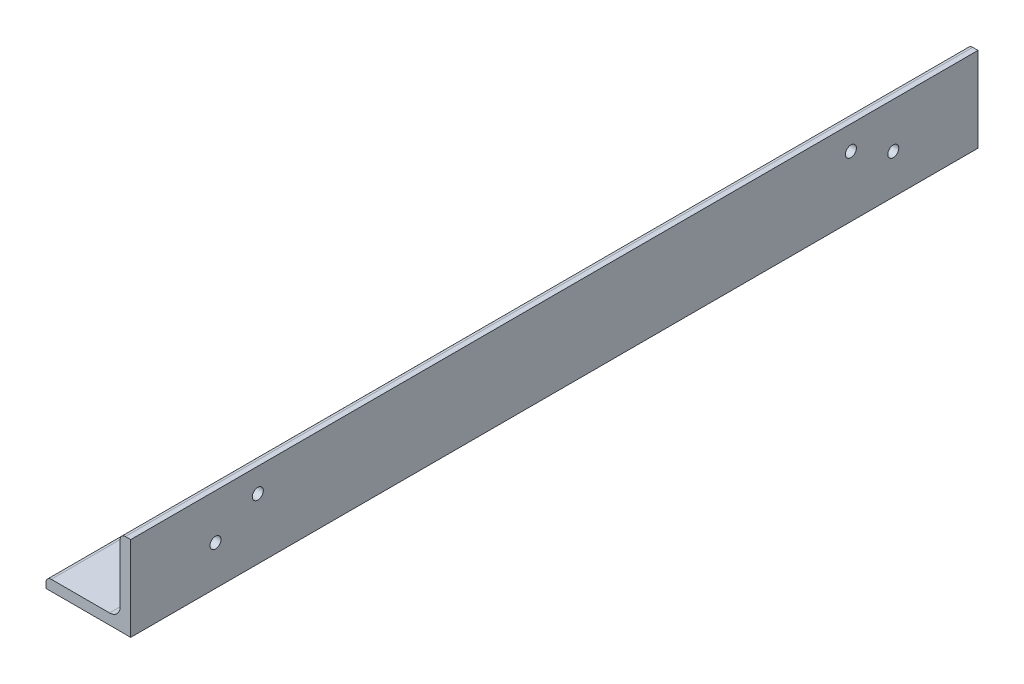
ISO-10303-21;
HEADER;
FILE_DESCRIPTION(('STEP AP214'),'2;1');
FILE_NAME('part.step','',(''),(''),'','','');
FILE_SCHEMA(('AUTOMOTIVE_DESIGN { 1 0 10303 214 1 1 1 1 }'));
ENDSEC;
DATA;
#1=APPLICATION_CONTEXT('core data for automotive mechanical design processes');
#2=APPLICATION_PROTOCOL_DEFINITION('international standard','automotive_design',2000,#1);
#3=PRODUCT_CONTEXT('',#1,'mechanical');
#4=PRODUCT('Part','Part','',(#3));
#5=PRODUCT_RELATED_PRODUCT_CATEGORY('part','',(#4));
#6=PRODUCT_DEFINITION_FORMATION('','',#4);
#7=PRODUCT_DEFINITION_CONTEXT('part definition',#1,'design');
#8=PRODUCT_DEFINITION('design','',#6,#7);
#9=PRODUCT_DEFINITION_SHAPE('','',#8);
#10=(LENGTH_UNIT() NAMED_UNIT(*) SI_UNIT(.MILLI.,.METRE.));
#11=(NAMED_UNIT(*) PLANE_ANGLE_UNIT() SI_UNIT($,.RADIAN.));
#12=(NAMED_UNIT(*) SI_UNIT($,.STERADIAN.) SOLID_ANGLE_UNIT());
#13=UNCERTAINTY_MEASURE_WITH_UNIT(LENGTH_MEASURE(1.E-05),#10,'distance_accuracy_value','');
#14=(GEOMETRIC_REPRESENTATION_CONTEXT(3) GLOBAL_UNCERTAINTY_ASSIGNED_CONTEXT((#13)) GLOBAL_UNIT_ASSIGNED_CONTEXT((#10,
#11,#12)) REPRESENTATION_CONTEXT('',''));
#15=CARTESIAN_POINT('',(0.,0.,0.));
#16=DIRECTION('',(0.,0.,1.));
#17=DIRECTION('',(1.,0.,0.));
#18=AXIS2_PLACEMENT_3D('',#15,#16,#17);
#19=CARTESIAN_POINT('',(-12.7,-12.7,127.));
#20=DIRECTION('',(0.,1.,0.));
#21=DIRECTION('',(-1.,0.,0.));
#22=AXIS2_PLACEMENT_3D('',#19,#20,#21);
#23=PLANE('',#22);
#24=CARTESIAN_POINT('',(-2.38124999999999,-12.7,77.7021348847287));
#25=DIRECTION('',(0.,1.,0.));
#26=DIRECTION('',(1.,0.,0.));
#27=AXIS2_PLACEMENT_3D('',#24,#25,#26);
#28=CIRCLE('',#27,6.35);
#29=CARTESIAN_POINT('',(3.96875,-12.7,77.7021348847287));
#30=VERTEX_POINT('',#29);
#31=EDGE_CURVE('E338',#30,#30,#28,.T.);
#32=ORIENTED_EDGE('',*,*,#31,.T.);
#33=EDGE_LOOP('',(#32));
#34=FACE_BOUND('',#33,.T.);
#35=CARTESIAN_POINT('',(-2.22255013737052,-12.7,58.7554424552496));
#36=DIRECTION('',(0.,1.,0.));
#37=DIRECTION('',(1.,0.,0.));
#38=AXIS2_PLACEMENT_3D('',#35,#36,#37);
#39=CIRCLE('',#38,6.32380079775954);
#40=CARTESIAN_POINT('',(4.10125066038902,-12.7,58.7554424552496));
#41=VERTEX_POINT('',#40);
#42=EDGE_CURVE('E346',#41,#41,#39,.T.);
#43=ORIENTED_EDGE('',*,*,#42,.T.);
#44=EDGE_LOOP('',(#43));
#45=FACE_BOUND('',#44,.T.);
#46=CARTESIAN_POINT('',(-2.38125,-12.7,0.));
#47=DIRECTION('',(0.,1.,0.));
#48=DIRECTION('',(-1.,0.,0.));
#49=AXIS2_PLACEMENT_3D('',#46,#47,#48);
#50=CIRCLE('',#49,6.46087620450385);
#51=CARTESIAN_POINT('',(-8.84212620450384,-12.7,0.));
#52=VERTEX_POINT('',#51);
#53=EDGE_CURVE('E354',#52,#52,#50,.T.);
#54=ORIENTED_EDGE('',*,*,#53,.T.);
#55=EDGE_LOOP('',(#54));
#56=FACE_BOUND('',#55,.T.);
#57=CARTESIAN_POINT('',(-2.3837482524853,-12.7,-20.5514891730489));
#58=DIRECTION('',(0.,1.,0.));
#59=DIRECTION('',(-1.,0.,0.));
#60=AXIS2_PLACEMENT_3D('',#57,#58,#59);
#61=CIRCLE('',#60,6.32380079775954);
#62=CARTESIAN_POINT('',(-8.70754905024484,-12.7,-20.5514891730489));
#63=VERTEX_POINT('',#62);
#64=EDGE_CURVE('E323',#63,#63,#61,.T.);
#65=ORIENTED_EDGE('',*,*,#64,.T.);
#66=EDGE_LOOP('',(#65));
#67=FACE_BOUND('',#66,.T.);
#68=CARTESIAN_POINT('',(-2.38124999999999,-12.7,-77.7021348847287));
#69=DIRECTION('',(0.,1.,0.));
#70=DIRECTION('',(-1.,0.,0.));
#71=AXIS2_PLACEMENT_3D('',#68,#69,#70);
#72=CIRCLE('',#71,6.35);
#73=CARTESIAN_POINT('',(-8.73124999999999,-12.7,-77.7021348847287));
#74=VERTEX_POINT('',#73);
#75=EDGE_CURVE('E275',#74,#74,#72,.T.);
#76=ORIENTED_EDGE('',*,*,#75,.T.);
#77=EDGE_LOOP('',(#76));
#78=FACE_BOUND('',#77,.T.);
#79=CARTESIAN_POINT('',(-2.3837482524853,-12.7,20.551489173049));
#80=DIRECTION('',(0.,1.,0.));
#81=DIRECTION('',(1.,0.,0.));
#82=AXIS2_PLACEMENT_3D('',#79,#80,#81);
#83=CIRCLE('',#82,6.32380079775954);
#84=CARTESIAN_POINT('',(3.94005254527424,-12.7,20.551489173049));
#85=VERTEX_POINT('',#84);
#86=EDGE_CURVE('E322',#85,#85,#83,.T.);
#87=ORIENTED_EDGE('',*,*,#86,.T.);
#88=EDGE_LOOP('',(#87));
#89=FACE_BOUND('',#88,.T.);
#90=CARTESIAN_POINT('',(-2.06135202225574,-12.7,-38.6056780659032));
#91=DIRECTION('',(0.,1.,0.));
#92=DIRECTION('',(-1.,0.,0.));
#93=AXIS2_PLACEMENT_3D('',#90,#91,#92);
#94=CIRCLE('',#93,6.32380079775954);
#95=CARTESIAN_POINT('',(-8.38515282001528,-12.7,-38.6056780659032));
#96=VERTEX_POINT('',#95);
#97=EDGE_CURVE('E307',#96,#96,#94,.T.);
#98=ORIENTED_EDGE('',*,*,#97,.T.);
#99=EDGE_LOOP('',(#98));
#100=FACE_BOUND('',#99,.T.);
#101=CARTESIAN_POINT('',(-2.22255013737052,-12.7,-58.7554424552494));
#102=DIRECTION('',(0.,1.,0.));
#103=DIRECTION('',(-1.,0.,0.));
#104=AXIS2_PLACEMENT_3D('',#101,#102,#103);
#105=CIRCLE('',#104,6.32380079775954);
#106=CARTESIAN_POINT('',(-8.54635093513006,-12.7,-58.7554424552494));
#107=VERTEX_POINT('',#106);
#108=EDGE_CURVE('E306',#107,#107,#105,.T.);
#109=ORIENTED_EDGE('',*,*,#108,.T.);
#110=EDGE_LOOP('',(#109));
#111=FACE_BOUND('',#110,.T.);
#112=CARTESIAN_POINT('',(-2.06135202225574,-12.7,38.6056780659033));
#113=DIRECTION('',(0.,1.,0.));
#114=DIRECTION('',(1.,0.,0.));
#115=AXIS2_PLACEMENT_3D('',#112,#113,#114);
#116=CIRCLE('',#115,6.32380079775954);
#117=CARTESIAN_POINT('',(4.2624487755038,-12.7,38.6056780659033));
#118=VERTEX_POINT('',#117);
#119=EDGE_CURVE('E298',#118,#118,#116,.T.);
#120=ORIENTED_EDGE('',*,*,#119,.T.);
#121=EDGE_LOOP('',(#120));
#122=FACE_BOUND('',#121,.T.);
#123=CARTESIAN_POINT('',(-5.55624999999999,-12.7,-101.6));
#124=DIRECTION('',(0.,1.,0.));
#125=DIRECTION('',(-1.,0.,0.));
#126=AXIS2_PLACEMENT_3D('',#123,#124,#125);
#127=CIRCLE('',#126,1.651);
#128=CARTESIAN_POINT('',(-7.20724999999999,-12.7,-101.6));
#129=VERTEX_POINT('',#128);
#130=EDGE_CURVE('E255',#129,#129,#127,.T.);
#131=ORIENTED_EDGE('',*,*,#130,.T.);
#132=EDGE_LOOP('',(#131));
#133=FACE_BOUND('',#132,.T.);
#134=CARTESIAN_POINT('',(0.793750000000011,-12.7,-88.9078918619198));
#135=DIRECTION('',(0.,1.,0.));
#136=DIRECTION('',(-1.,0.,0.));
#137=AXIS2_PLACEMENT_3D('',#134,#135,#136);
#138=CIRCLE('',#137,1.65099999999999);
#139=CARTESIAN_POINT('',(-0.857249999999982,-12.7,-88.9078918619198));
#140=VERTEX_POINT('',#139);
#141=EDGE_CURVE('E155',#140,#140,#138,.T.);
#142=ORIENTED_EDGE('',*,*,#141,.T.);
#143=EDGE_LOOP('',(#142));
#144=FACE_BOUND('',#143,.T.);
#145=DIRECTION('',(1.,0.,0.));
#146=VECTOR('',#145,1.);
#147=CARTESIAN_POINT('',(-12.7,-12.7,-127.));
#148=LINE('',#147,#146);
#149=CARTESIAN_POINT('',(-12.7,-12.7,-127.));
#150=VERTEX_POINT('',#149);
#151=CARTESIAN_POINT('',(12.7,-12.7,-127.));
#152=VERTEX_POINT('',#151);
#153=EDGE_CURVE('E154',#150,#152,#148,.T.);
#154=ORIENTED_EDGE('',*,*,#153,.T.);
#155=DIRECTION('',(0.,0.,-1.));
#156=VECTOR('',#155,1.);
#157=CARTESIAN_POINT('',(12.7,-12.7,127.));
#158=LINE('',#157,#156);
#159=CARTESIAN_POINT('',(12.7,-12.7,127.));
#160=VERTEX_POINT('',#159);
#161=EDGE_CURVE('E51',#160,#152,#158,.T.);
#162=ORIENTED_EDGE('',*,*,#161,.F.);
#163=DIRECTION('',(1.,0.,0.));
#164=VECTOR('',#163,1.);
#165=CARTESIAN_POINT('',(-12.7,-12.7,127.));
#166=LINE('',#165,#164);
#167=CARTESIAN_POINT('',(-12.7,-12.7,127.));
#168=VERTEX_POINT('',#167);
#169=EDGE_CURVE('E105',#168,#160,#166,.T.);
#170=ORIENTED_EDGE('',*,*,#169,.F.);
#171=DIRECTION('',(0.,0.,-1.));
#172=VECTOR('',#171,1.);
#173=CARTESIAN_POINT('',(-12.7,-12.7,127.));
#174=LINE('',#173,#172);
#175=EDGE_CURVE('E11',#168,#150,#174,.T.);
#176=ORIENTED_EDGE('',*,*,#175,.T.);
#177=EDGE_LOOP('',(#154,#162,#170,#176));
#178=FACE_BOUND('',#177,.T.);
#179=CARTESIAN_POINT('',(-5.55624999999997,-12.7,101.6));
#180=DIRECTION('',(0.,-1.,0.));
#181=DIRECTION('',(1.,0.,0.));
#182=AXIS2_PLACEMENT_3D('',#179,#180,#181);
#183=CIRCLE('',#182,1.651);
#184=CARTESIAN_POINT('',(-3.90524999999997,-12.7,101.6));
#185=VERTEX_POINT('',#184);
#186=EDGE_CURVE('E247',#185,#185,#183,.T.);
#187=ORIENTED_EDGE('',*,*,#186,.F.);
#188=EDGE_LOOP('',(#187));
#189=FACE_BOUND('',#188,.T.);
#190=CARTESIAN_POINT('',(0.793750000000033,-12.7,88.9078918619198));
#191=DIRECTION('',(0.,-1.,0.));
#192=DIRECTION('',(1.,0.,0.));
#193=AXIS2_PLACEMENT_3D('',#190,#191,#192);
#194=CIRCLE('',#193,1.651);
#195=CARTESIAN_POINT('',(2.44475000000003,-12.7,88.9078918619198));
#196=VERTEX_POINT('',#195);
#197=EDGE_CURVE('E238',#196,#196,#194,.T.);
#198=ORIENTED_EDGE('',*,*,#197,.F.);
#199=EDGE_LOOP('',(#198));
#200=FACE_BOUND('',#199,.T.);
#201=ADVANCED_FACE('F41',(#34,#45,#56,#67,#78,#89,#100,#111,#122,#133,#144,#178,#189,#200),#23,.F.);
#202=CARTESIAN_POINT('',(6.35,-9.525,127.));
#203=DIRECTION('',(0.,-1.,0.));
#204=DIRECTION('',(1.,0.,0.));
#205=AXIS2_PLACEMENT_3D('',#202,#203,#204);
#206=PLANE('',#205);
#207=CARTESIAN_POINT('',(-2.38124999999999,-9.525,77.7021348847287));
#208=DIRECTION('',(0.,1.,0.));
#209=DIRECTION('',(1.,0.,0.));
#210=AXIS2_PLACEMENT_3D('',#207,#208,#209);
#211=CIRCLE('',#210,6.35);
#212=CARTESIAN_POINT('',(3.96875,-9.525,77.7021348847287));
#213=VERTEX_POINT('',#212);
#214=EDGE_CURVE('E334',#213,#213,#211,.T.);
#215=ORIENTED_EDGE('',*,*,#214,.F.);
#216=EDGE_LOOP('',(#215));
#217=FACE_BOUND('',#216,.T.);
#218=CARTESIAN_POINT('',(-2.22255013737052,-9.525,58.7554424552496));
#219=DIRECTION('',(0.,1.,0.));
#220=DIRECTION('',(1.,0.,0.));
#221=AXIS2_PLACEMENT_3D('',#218,#219,#220);
#222=CIRCLE('',#221,6.32380079775954);
#223=CARTESIAN_POINT('',(4.10125066038902,-9.525,58.7554424552496));
#224=VERTEX_POINT('',#223);
#225=EDGE_CURVE('E342',#224,#224,#222,.T.);
#226=ORIENTED_EDGE('',*,*,#225,.F.);
#227=EDGE_LOOP('',(#226));
#228=FACE_BOUND('',#227,.T.);
#229=CARTESIAN_POINT('',(-2.38125,-9.525,0.));
#230=DIRECTION('',(0.,1.,0.));
#231=DIRECTION('',(-1.,0.,0.));
#232=AXIS2_PLACEMENT_3D('',#229,#230,#231);
#233=CIRCLE('',#232,6.46087620450385);
#234=CARTESIAN_POINT('',(-8.84212620450384,-9.525,0.));
#235=VERTEX_POINT('',#234);
#236=EDGE_CURVE('E350',#235,#235,#233,.T.);
#237=ORIENTED_EDGE('',*,*,#236,.F.);
#238=EDGE_LOOP('',(#237));
#239=FACE_BOUND('',#238,.T.);
#240=CARTESIAN_POINT('',(-2.3837482524853,-9.525,-20.5514891730489));
#241=DIRECTION('',(0.,1.,0.));
#242=DIRECTION('',(-1.,0.,0.));
#243=AXIS2_PLACEMENT_3D('',#240,#241,#242);
#244=CIRCLE('',#243,6.32380079775954);
#245=CARTESIAN_POINT('',(-8.70754905024484,-9.525,-20.5514891730489));
#246=VERTEX_POINT('',#245);
#247=EDGE_CURVE('E358',#246,#246,#244,.T.);
#248=ORIENTED_EDGE('',*,*,#247,.F.);
#249=EDGE_LOOP('',(#248));
#250=FACE_BOUND('',#249,.T.);
#251=CARTESIAN_POINT('',(-2.38124999999999,-9.525,-77.7021348847287));
#252=DIRECTION('',(0.,1.,0.));
#253=DIRECTION('',(-1.,0.,0.));
#254=AXIS2_PLACEMENT_3D('',#251,#252,#253);
#255=CIRCLE('',#254,6.35);
#256=CARTESIAN_POINT('',(-8.73124999999999,-9.525,-77.7021348847287));
#257=VERTEX_POINT('',#256);
#258=EDGE_CURVE('E294',#257,#257,#255,.T.);
#259=ORIENTED_EDGE('',*,*,#258,.F.);
#260=EDGE_LOOP('',(#259));
#261=FACE_BOUND('',#260,.T.);
#262=CARTESIAN_POINT('',(-2.3837482524853,-9.525,20.551489173049));
#263=DIRECTION('',(0.,1.,0.));
#264=DIRECTION('',(1.,0.,0.));
#265=AXIS2_PLACEMENT_3D('',#262,#263,#264);
#266=CIRCLE('',#265,6.32380079775954);
#267=CARTESIAN_POINT('',(3.94005254527424,-9.525,20.551489173049));
#268=VERTEX_POINT('',#267);
#269=EDGE_CURVE('E318',#268,#268,#266,.T.);
#270=ORIENTED_EDGE('',*,*,#269,.F.);
#271=EDGE_LOOP('',(#270));
#272=FACE_BOUND('',#271,.T.);
#273=CARTESIAN_POINT('',(-2.06135202225574,-9.525,-38.6056780659032));
#274=DIRECTION('',(0.,1.,0.));
#275=DIRECTION('',(-1.,0.,0.));
#276=AXIS2_PLACEMENT_3D('',#273,#274,#275);
#277=CIRCLE('',#276,6.32380079775954);
#278=CARTESIAN_POINT('',(-8.38515282001528,-9.525,-38.6056780659032));
#279=VERTEX_POINT('',#278);
#280=EDGE_CURVE('E327',#279,#279,#277,.T.);
#281=ORIENTED_EDGE('',*,*,#280,.F.);
#282=EDGE_LOOP('',(#281));
#283=FACE_BOUND('',#282,.T.);
#284=CARTESIAN_POINT('',(-2.22255013737052,-9.525,-58.7554424552494));
#285=DIRECTION('',(0.,1.,0.));
#286=DIRECTION('',(-1.,0.,0.));
#287=AXIS2_PLACEMENT_3D('',#284,#285,#286);
#288=CIRCLE('',#287,6.32380079775954);
#289=CARTESIAN_POINT('',(-8.54635093513006,-9.525,-58.7554424552494));
#290=VERTEX_POINT('',#289);
#291=EDGE_CURVE('E302',#290,#290,#288,.T.);
#292=ORIENTED_EDGE('',*,*,#291,.F.);
#293=EDGE_LOOP('',(#292));
#294=FACE_BOUND('',#293,.T.);
#295=CARTESIAN_POINT('',(-2.06135202225574,-9.525,38.6056780659033));
#296=DIRECTION('',(0.,1.,0.));
#297=DIRECTION('',(1.,0.,0.));
#298=AXIS2_PLACEMENT_3D('',#295,#296,#297);
#299=CIRCLE('',#298,6.32380079775954);
#300=CARTESIAN_POINT('',(4.2624487755038,-9.525,38.6056780659033));
#301=VERTEX_POINT('',#300);
#302=EDGE_CURVE('E311',#301,#301,#299,.T.);
#303=ORIENTED_EDGE('',*,*,#302,.F.);
#304=EDGE_LOOP('',(#303));
#305=FACE_BOUND('',#304,.T.);
#306=CARTESIAN_POINT('',(-5.55624999999999,-9.525,-101.6));
#307=DIRECTION('',(0.,1.,0.));
#308=DIRECTION('',(-1.,0.,0.));
#309=AXIS2_PLACEMENT_3D('',#306,#307,#308);
#310=CIRCLE('',#309,1.651);
#311=CARTESIAN_POINT('',(-7.20724999999999,-9.525,-101.6));
#312=VERTEX_POINT('',#311);
#313=EDGE_CURVE('E234',#312,#312,#310,.T.);
#314=ORIENTED_EDGE('',*,*,#313,.F.);
#315=EDGE_LOOP('',(#314));
#316=FACE_BOUND('',#315,.T.);
#317=CARTESIAN_POINT('',(0.793750000000011,-9.525,-88.9078918619198));
#318=DIRECTION('',(0.,1.,0.));
#319=DIRECTION('',(-1.,0.,0.));
#320=AXIS2_PLACEMENT_3D('',#317,#318,#319);
#321=CIRCLE('',#320,1.65099999999999);
#322=CARTESIAN_POINT('',(-0.857249999999983,-9.525,-88.9078918619198));
#323=VERTEX_POINT('',#322);
#324=EDGE_CURVE('E230',#323,#323,#321,.T.);
#325=ORIENTED_EDGE('',*,*,#324,.F.);
#326=EDGE_LOOP('',(#325));
#327=FACE_BOUND('',#326,.T.);
#328=DIRECTION('',(-1.,0.,0.));
#329=VECTOR('',#328,1.);
#330=CARTESIAN_POINT('',(6.35,-9.525,-127.));
#331=LINE('',#330,#329);
#332=CARTESIAN_POINT('',(6.35,-9.525,-127.));
#333=VERTEX_POINT('',#332);
#334=CARTESIAN_POINT('',(-11.1125,-9.525,-127.));
#335=VERTEX_POINT('',#334);
#336=EDGE_CURVE('E91',#333,#335,#331,.T.);
#337=ORIENTED_EDGE('',*,*,#336,.T.);
#338=DIRECTION('',(0.,0.,-1.));
#339=VECTOR('',#338,1.);
#340=CARTESIAN_POINT('',(-11.1125,-9.525,127.));
#341=LINE('',#340,#339);
#342=CARTESIAN_POINT('',(-11.1125,-9.525,127.));
#343=VERTEX_POINT('',#342);
#344=EDGE_CURVE('E139',#343,#335,#341,.T.);
#345=ORIENTED_EDGE('',*,*,#344,.F.);
#346=DIRECTION('',(-1.,0.,0.));
#347=VECTOR('',#346,1.);
#348=CARTESIAN_POINT('',(6.35,-9.525,127.));
#349=LINE('',#348,#347);
#350=CARTESIAN_POINT('',(6.35,-9.525,127.));
#351=VERTEX_POINT('',#350);
#352=EDGE_CURVE('E125',#351,#343,#349,.T.);
#353=ORIENTED_EDGE('',*,*,#352,.F.);
#354=DIRECTION('',(0.,0.,-1.));
#355=VECTOR('',#354,1.);
#356=CARTESIAN_POINT('',(6.35,-9.525,127.));
#357=LINE('',#356,#355);
#358=EDGE_CURVE('E133',#351,#333,#357,.T.);
#359=ORIENTED_EDGE('',*,*,#358,.T.);
#360=EDGE_LOOP('',(#337,#345,#353,#359));
#361=FACE_BOUND('',#360,.T.);
#362=CARTESIAN_POINT('',(-5.55624999999997,-9.525,101.6));
#363=DIRECTION('',(0.,-1.,0.));
#364=DIRECTION('',(1.,0.,0.));
#365=AXIS2_PLACEMENT_3D('',#362,#363,#364);
#366=CIRCLE('',#365,1.651);
#367=CARTESIAN_POINT('',(-3.90524999999997,-9.525,101.6));
#368=VERTEX_POINT('',#367);
#369=EDGE_CURVE('E251',#368,#368,#366,.T.);
#370=ORIENTED_EDGE('',*,*,#369,.T.);
#371=EDGE_LOOP('',(#370));
#372=FACE_BOUND('',#371,.T.);
#373=CARTESIAN_POINT('',(0.793750000000032,-9.525,88.9078918619198));
#374=DIRECTION('',(0.,-1.,0.));
#375=DIRECTION('',(1.,0.,0.));
#376=AXIS2_PLACEMENT_3D('',#373,#374,#375);
#377=CIRCLE('',#376,1.651);
#378=CARTESIAN_POINT('',(2.44475000000003,-9.525,88.9078918619198));
#379=VERTEX_POINT('',#378);
#380=EDGE_CURVE('E242',#379,#379,#377,.T.);
#381=ORIENTED_EDGE('',*,*,#380,.T.);
#382=EDGE_LOOP('',(#381));
#383=FACE_BOUND('',#382,.T.);
#384=ADVANCED_FACE('F141',(#217,#228,#239,#250,#261,#272,#283,#294,#305,#316,#327,#361,#372,
#383),#206,.F.);
#385=CARTESIAN_POINT('',(-12.7,-11.1125,127.));
#386=DIRECTION('',(1.,0.,0.));
#387=DIRECTION('',(0.,0.,-1.));
#388=AXIS2_PLACEMENT_3D('',#385,#386,#387);
#389=PLANE('',#388);
#390=DIRECTION('',(0.,-1.,0.));
#391=VECTOR('',#390,1.);
#392=CARTESIAN_POINT('',(-12.7,-11.1125,-127.));
#393=LINE('',#392,#391);
#394=CARTESIAN_POINT('',(-12.7,-11.1125,-127.));
#395=VERTEX_POINT('',#394);
#396=EDGE_CURVE('E150',#395,#150,#393,.T.);
#397=ORIENTED_EDGE('',*,*,#396,.T.);
#398=ORIENTED_EDGE('',*,*,#175,.F.);
#399=DIRECTION('',(0.,-1.,0.));
#400=VECTOR('',#399,1.);
#401=CARTESIAN_POINT('',(-12.7,-11.1125,127.));
#402=LINE('',#401,#400);
#403=CARTESIAN_POINT('',(-12.7,-11.1125,127.));
#404=VERTEX_POINT('',#403);
#405=EDGE_CURVE('E176',#404,#168,#402,.T.);
#406=ORIENTED_EDGE('',*,*,#405,.F.);
#407=DIRECTION('',(0.,0.,-1.));
#408=VECTOR('',#407,1.);
#409=CARTESIAN_POINT('',(-12.7,-11.1125,127.));
#410=LINE('',#409,#408);
#411=EDGE_CURVE('E146',#404,#395,#410,.T.);
#412=ORIENTED_EDGE('',*,*,#411,.T.);
#413=EDGE_LOOP('',(#397,#398,#406,#412));
#414=FACE_BOUND('',#413,.T.);
#415=ADVANCED_FACE('F43',(#414),#389,.F.);
#416=CARTESIAN_POINT('',(12.7,-12.7,127.));
#417=DIRECTION('',(-1.,0.,0.));
#418=DIRECTION('',(0.,-1.,0.));
#419=AXIS2_PLACEMENT_3D('',#416,#417,#418);
#420=PLANE('',#419);
#421=CARTESIAN_POINT('',(12.7,-0.793749999999997,101.6));
#422=DIRECTION('',(-1.,0.,0.));
#423=DIRECTION('',(0.,1.,0.));
#424=AXIS2_PLACEMENT_3D('',#421,#422,#423);
#425=CIRCLE('',#424,1.65100000000001);
#426=CARTESIAN_POINT('',(12.7,0.857250000000009,101.6));
#427=VERTEX_POINT('',#426);
#428=EDGE_CURVE('E274',#427,#427,#425,.T.);
#429=ORIENTED_EDGE('',*,*,#428,.T.);
#430=EDGE_LOOP('',(#429));
#431=FACE_BOUND('',#430,.T.);
#432=CARTESIAN_POINT('',(12.7,5.55625000000002,88.9));
#433=DIRECTION('',(-1.,0.,0.));
#434=DIRECTION('',(0.,1.,0.));
#435=AXIS2_PLACEMENT_3D('',#432,#433,#434);
#436=CIRCLE('',#435,1.65100000000001);
#437=CARTESIAN_POINT('',(12.7,7.20725000000003,88.9));
#438=VERTEX_POINT('',#437);
#439=EDGE_CURVE('E283',#438,#438,#436,.T.);
#440=ORIENTED_EDGE('',*,*,#439,.T.);
#441=EDGE_LOOP('',(#440));
#442=FACE_BOUND('',#441,.T.);
#443=CARTESIAN_POINT('',(12.7,-0.793749999999997,-101.6));
#444=DIRECTION('',(-1.,0.,0.));
#445=DIRECTION('',(0.,-1.,0.));
#446=AXIS2_PLACEMENT_3D('',#443,#444,#445);
#447=CIRCLE('',#446,1.65100000000001);
#448=CARTESIAN_POINT('',(12.7,-2.44475,-101.6));
#449=VERTEX_POINT('',#448);
#450=EDGE_CURVE('E266',#449,#449,#447,.T.);
#451=ORIENTED_EDGE('',*,*,#450,.T.);
#452=EDGE_LOOP('',(#451));
#453=FACE_BOUND('',#452,.T.);
#454=CARTESIAN_POINT('',(12.7,5.55625,-88.9));
#455=DIRECTION('',(-1.,0.,0.));
#456=DIRECTION('',(0.,-1.,0.));
#457=AXIS2_PLACEMENT_3D('',#454,#455,#456);
#458=CIRCLE('',#457,1.65100000000001);
#459=CARTESIAN_POINT('',(12.7,3.90524999999999,-88.9));
#460=VERTEX_POINT('',#459);
#461=EDGE_CURVE('E243',#460,#460,#458,.T.);
#462=ORIENTED_EDGE('',*,*,#461,.T.);
#463=EDGE_LOOP('',(#462));
#464=FACE_BOUND('',#463,.T.);
#465=DIRECTION('',(0.,1.,0.));
#466=VECTOR('',#465,1.);
#467=CARTESIAN_POINT('',(12.7,-12.7,-127.));
#468=LINE('',#467,#466);
#469=CARTESIAN_POINT('',(12.7,12.7,-127.));
#470=VERTEX_POINT('',#469);
#471=EDGE_CURVE('E158',#152,#470,#468,.T.);
#472=ORIENTED_EDGE('',*,*,#471,.T.);
#473=DIRECTION('',(0.,0.,-1.));
#474=VECTOR('',#473,1.);
#475=CARTESIAN_POINT('',(12.7,12.7,127.));
#476=LINE('',#475,#474);
#477=CARTESIAN_POINT('',(12.7,12.7,127.));
#478=VERTEX_POINT('',#477);
#479=EDGE_CURVE('E191',#478,#470,#476,.T.);
#480=ORIENTED_EDGE('',*,*,#479,.F.);
#481=DIRECTION('',(0.,1.,0.));
#482=VECTOR('',#481,1.);
#483=CARTESIAN_POINT('',(12.7,-12.7,127.));
#484=LINE('',#483,#482);
#485=EDGE_CURVE('E201',#160,#478,#484,.T.);
#486=ORIENTED_EDGE('',*,*,#485,.F.);
#487=ORIENTED_EDGE('',*,*,#161,.T.);
#488=EDGE_LOOP('',(#472,#480,#486,#487));
#489=FACE_BOUND('',#488,.T.);
#490=ADVANCED_FACE('F199',(#431,#442,#453,#464,#489),#420,.F.);
#491=CARTESIAN_POINT('',(11.1125,12.7,127.));
#492=DIRECTION('',(0.,-1.,0.));
#493=DIRECTION('',(0.,0.,-1.));
#494=AXIS2_PLACEMENT_3D('',#491,#492,#493);
#495=PLANE('',#494);
#496=DIRECTION('',(-1.,0.,0.));
#497=VECTOR('',#496,1.);
#498=CARTESIAN_POINT('',(11.1125,12.7,-127.));
#499=LINE('',#498,#497);
#500=CARTESIAN_POINT('',(11.1125,12.7,-127.));
#501=VERTEX_POINT('',#500);
#502=EDGE_CURVE('E161',#470,#501,#499,.T.);
#503=ORIENTED_EDGE('',*,*,#502,.T.);
#504=DIRECTION('',(0.,0.,-1.));
#505=VECTOR('',#504,1.);
#506=CARTESIAN_POINT('',(11.1125,12.7,127.));
#507=LINE('',#506,#505);
#508=CARTESIAN_POINT('',(11.1125,12.7,127.));
#509=VERTEX_POINT('',#508);
#510=EDGE_CURVE('E187',#509,#501,#507,.T.);
#511=ORIENTED_EDGE('',*,*,#510,.F.);
#512=DIRECTION('',(-1.,0.,0.));
#513=VECTOR('',#512,1.);
#514=CARTESIAN_POINT('',(11.1125,12.7,127.));
#515=LINE('',#514,#513);
#516=EDGE_CURVE('E218',#478,#509,#515,.T.);
#517=ORIENTED_EDGE('',*,*,#516,.F.);
#518=ORIENTED_EDGE('',*,*,#479,.T.);
#519=EDGE_LOOP('',(#503,#511,#517,#518));
#520=FACE_BOUND('',#519,.T.);
#521=ADVANCED_FACE('F210',(#520),#495,.F.);
#522=CARTESIAN_POINT('',(11.1125,11.1125,127.));
#523=DIRECTION('',(0.,0.,-1.));
#524=DIRECTION('',(-1.,0.,0.));
#525=AXIS2_PLACEMENT_3D('',#522,#523,#524);
#526=CYLINDRICAL_SURFACE('',#525,1.5875);
#527=CARTESIAN_POINT('',(11.1125,11.1125,-127.));
#528=DIRECTION('',(0.,0.,1.));
#529=DIRECTION('',(-1.,0.,0.));
#530=AXIS2_PLACEMENT_3D('',#527,#528,#529);
#531=CIRCLE('',#530,1.5875);
#532=CARTESIAN_POINT('',(9.525,11.1125,-127.));
#533=VERTEX_POINT('',#532);
#534=EDGE_CURVE('E164',#501,#533,#531,.T.);
#535=ORIENTED_EDGE('',*,*,#534,.T.);
#536=DIRECTION('',(0.,0.,-1.));
#537=VECTOR('',#536,1.);
#538=CARTESIAN_POINT('',(9.525,11.1125,127.));
#539=LINE('',#538,#537);
#540=CARTESIAN_POINT('',(9.525,11.1125,127.));
#541=VERTEX_POINT('',#540);
#542=EDGE_CURVE('E183',#541,#533,#539,.T.);
#543=ORIENTED_EDGE('',*,*,#542,.F.);
#544=CARTESIAN_POINT('',(11.1125,11.1125,127.));
#545=DIRECTION('',(0.,0.,1.));
#546=DIRECTION('',(-1.,0.,0.));
#547=AXIS2_PLACEMENT_3D('',#544,#545,#546);
#548=CIRCLE('',#547,1.5875);
#549=EDGE_CURVE('E216',#509,#541,#548,.T.);
#550=ORIENTED_EDGE('',*,*,#549,.F.);
#551=ORIENTED_EDGE('',*,*,#510,.T.);
#552=EDGE_LOOP('',(#535,#543,#550,#551));
#553=FACE_BOUND('',#552,.T.);
#554=ADVANCED_FACE('F214',(#553),#526,.T.);
#555=CARTESIAN_POINT('',(9.525,11.1125,127.));
#556=DIRECTION('',(1.,0.,0.));
#557=DIRECTION('',(0.,1.,0.));
#558=AXIS2_PLACEMENT_3D('',#555,#556,#557);
#559=PLANE('',#558);
#560=CARTESIAN_POINT('',(9.525,-0.793749999999997,101.6));
#561=DIRECTION('',(-1.,0.,0.));
#562=DIRECTION('',(0.,1.,0.));
#563=AXIS2_PLACEMENT_3D('',#560,#561,#562);
#564=CIRCLE('',#563,1.65100000000001);
#565=CARTESIAN_POINT('',(9.525,0.857250000000009,101.6));
#566=VERTEX_POINT('',#565);
#567=EDGE_CURVE('E270',#566,#566,#564,.T.);
#568=ORIENTED_EDGE('',*,*,#567,.F.);
#569=EDGE_LOOP('',(#568));
#570=FACE_BOUND('',#569,.T.);
#571=CARTESIAN_POINT('',(9.525,5.55625000000002,88.9));
#572=DIRECTION('',(-1.,0.,0.));
#573=DIRECTION('',(0.,1.,0.));
#574=AXIS2_PLACEMENT_3D('',#571,#572,#573);
#575=CIRCLE('',#574,1.65100000000001);
#576=CARTESIAN_POINT('',(9.525,7.20725000000003,88.9));
#577=VERTEX_POINT('',#576);
#578=EDGE_CURVE('E279',#577,#577,#575,.T.);
#579=ORIENTED_EDGE('',*,*,#578,.F.);
#580=EDGE_LOOP('',(#579));
#581=FACE_BOUND('',#580,.T.);
#582=CARTESIAN_POINT('',(9.525,-0.793749999999997,-101.6));
#583=DIRECTION('',(-1.,0.,0.));
#584=DIRECTION('',(0.,-1.,0.));
#585=AXIS2_PLACEMENT_3D('',#582,#583,#584);
#586=CIRCLE('',#585,1.65100000000001);
#587=CARTESIAN_POINT('',(9.525,-2.44475,-101.6));
#588=VERTEX_POINT('',#587);
#589=EDGE_CURVE('E287',#588,#588,#586,.T.);
#590=ORIENTED_EDGE('',*,*,#589,.F.);
#591=EDGE_LOOP('',(#590));
#592=FACE_BOUND('',#591,.T.);
#593=CARTESIAN_POINT('',(9.525,5.55625,-88.9));
#594=DIRECTION('',(-1.,0.,0.));
#595=DIRECTION('',(0.,-1.,0.));
#596=AXIS2_PLACEMENT_3D('',#593,#594,#595);
#597=CIRCLE('',#596,1.65100000000001);
#598=CARTESIAN_POINT('',(9.525,3.90524999999999,-88.9));
#599=VERTEX_POINT('',#598);
#600=EDGE_CURVE('E262',#599,#599,#597,.T.);
#601=ORIENTED_EDGE('',*,*,#600,.F.);
#602=EDGE_LOOP('',(#601));
#603=FACE_BOUND('',#602,.T.);
#604=DIRECTION('',(0.,-1.,0.));
#605=VECTOR('',#604,1.);
#606=CARTESIAN_POINT('',(9.525,11.1125,-127.));
#607=LINE('',#606,#605);
#608=CARTESIAN_POINT('',(9.525,-6.35,-127.));
#609=VERTEX_POINT('',#608);
#610=EDGE_CURVE('E167',#533,#609,#607,.T.);
#611=ORIENTED_EDGE('',*,*,#610,.T.);
#612=DIRECTION('',(0.,0.,-1.));
#613=VECTOR('',#612,1.);
#614=CARTESIAN_POINT('',(9.525,-6.35,127.));
#615=LINE('',#614,#613);
#616=CARTESIAN_POINT('',(9.525,-6.35,127.));
#617=VERTEX_POINT('',#616);
#618=EDGE_CURVE('E138',#617,#609,#615,.T.);
#619=ORIENTED_EDGE('',*,*,#618,.F.);
#620=DIRECTION('',(0.,-1.,0.));
#621=VECTOR('',#620,1.);
#622=CARTESIAN_POINT('',(9.525,11.1125,127.));
#623=LINE('',#622,#621);
#624=EDGE_CURVE('E127',#541,#617,#623,.T.);
#625=ORIENTED_EDGE('',*,*,#624,.F.);
#626=ORIENTED_EDGE('',*,*,#542,.T.);
#627=EDGE_LOOP('',(#611,#619,#625,#626));
#628=FACE_BOUND('',#627,.T.);
#629=ADVANCED_FACE('F423',(#570,#581,#592,#603,#628),#559,.F.);
#630=CARTESIAN_POINT('',(6.35,-6.35,127.));
#631=DIRECTION('',(0.,0.,-1.));
#632=DIRECTION('',(-1.,0.,0.));
#633=AXIS2_PLACEMENT_3D('',#630,#631,#632);
#634=CYLINDRICAL_SURFACE('',#633,3.175);
#635=CARTESIAN_POINT('',(6.35,-6.35,-127.));
#636=DIRECTION('',(0.,0.,-1.));
#637=DIRECTION('',(-1.,0.,0.));
#638=AXIS2_PLACEMENT_3D('',#635,#636,#637);
#639=CIRCLE('',#638,3.175);
#640=EDGE_CURVE('E136',#609,#333,#639,.T.);
#641=ORIENTED_EDGE('',*,*,#640,.T.);
#642=ORIENTED_EDGE('',*,*,#358,.F.);
#643=CARTESIAN_POINT('',(6.35,-6.35,127.));
#644=DIRECTION('',(0.,0.,-1.));
#645=DIRECTION('',(-1.,0.,0.));
#646=AXIS2_PLACEMENT_3D('',#643,#644,#645);
#647=CIRCLE('',#646,3.175);
#648=EDGE_CURVE('E121',#617,#351,#647,.T.);
#649=ORIENTED_EDGE('',*,*,#648,.F.);
#650=ORIENTED_EDGE('',*,*,#618,.T.);
#651=EDGE_LOOP('',(#641,#642,#649,#650));
#652=FACE_BOUND('',#651,.T.);
#653=ADVANCED_FACE('F134',(#652),#634,.F.);
#654=CARTESIAN_POINT('',(-11.1125,-11.1125,127.));
#655=DIRECTION('',(0.,0.,-1.));
#656=DIRECTION('',(-1.,0.,0.));
#657=AXIS2_PLACEMENT_3D('',#654,#655,#656);
#658=CYLINDRICAL_SURFACE('',#657,1.5875);
#659=CARTESIAN_POINT('',(-11.1125,-11.1125,-127.));
#660=DIRECTION('',(0.,0.,1.));
#661=DIRECTION('',(-1.,0.,0.));
#662=AXIS2_PLACEMENT_3D('',#659,#660,#661);
#663=CIRCLE('',#662,1.5875);
#664=EDGE_CURVE('E97',#335,#395,#663,.T.);
#665=ORIENTED_EDGE('',*,*,#664,.T.);
#666=ORIENTED_EDGE('',*,*,#411,.F.);
#667=CARTESIAN_POINT('',(-11.1125,-11.1125,127.));
#668=DIRECTION('',(0.,0.,1.));
#669=DIRECTION('',(-1.,0.,0.));
#670=AXIS2_PLACEMENT_3D('',#667,#668,#669);
#671=CIRCLE('',#670,1.5875);
#672=EDGE_CURVE('E59',#343,#404,#671,.T.);
#673=ORIENTED_EDGE('',*,*,#672,.F.);
#674=ORIENTED_EDGE('',*,*,#344,.T.);
#675=EDGE_LOOP('',(#665,#666,#673,#674));
#676=FACE_BOUND('',#675,.T.);
#677=ADVANCED_FACE('F428',(#676),#658,.T.);
#678=CARTESIAN_POINT('',(11.1125,11.1125,127.));
#679=DIRECTION('',(0.,0.,-1.));
#680=DIRECTION('',(-1.,0.,0.));
#681=AXIS2_PLACEMENT_3D('',#678,#679,#680);
#682=PLANE('',#681);
#683=ORIENTED_EDGE('',*,*,#405,.T.);
#684=ORIENTED_EDGE('',*,*,#169,.T.);
#685=ORIENTED_EDGE('',*,*,#485,.T.);
#686=ORIENTED_EDGE('',*,*,#516,.T.);
#687=ORIENTED_EDGE('',*,*,#549,.T.);
#688=ORIENTED_EDGE('',*,*,#624,.T.);
#689=ORIENTED_EDGE('',*,*,#648,.T.);
#690=ORIENTED_EDGE('',*,*,#352,.T.);
#691=ORIENTED_EDGE('',*,*,#672,.T.);
#692=EDGE_LOOP('',(#683,#684,#685,#686,#687,#688,#689,#690,#691));
#693=FACE_BOUND('',#692,.T.);
#694=ADVANCED_FACE('F123',(#693),#682,.F.);
#695=CARTESIAN_POINT('',(11.1125,11.1125,-127.));
#696=DIRECTION('',(0.,0.,-1.));
#697=DIRECTION('',(-1.,0.,0.));
#698=AXIS2_PLACEMENT_3D('',#695,#696,#697);
#699=PLANE('',#698);
#700=ORIENTED_EDGE('',*,*,#396,.F.);
#701=ORIENTED_EDGE('',*,*,#664,.F.);
#702=ORIENTED_EDGE('',*,*,#336,.F.);
#703=ORIENTED_EDGE('',*,*,#640,.F.);
#704=ORIENTED_EDGE('',*,*,#610,.F.);
#705=ORIENTED_EDGE('',*,*,#534,.F.);
#706=ORIENTED_EDGE('',*,*,#502,.F.);
#707=ORIENTED_EDGE('',*,*,#471,.F.);
#708=ORIENTED_EDGE('',*,*,#153,.F.);
#709=EDGE_LOOP('',(#700,#701,#702,#703,#704,#705,#706,#707,#708));
#710=FACE_BOUND('',#709,.T.);
#711=ADVANCED_FACE('F205',(#710),#699,.T.);
#712=CARTESIAN_POINT('',(0.793750000000011,-12.7,-88.9078918619198));
#713=DIRECTION('',(0.,1.,0.));
#714=DIRECTION('',(-1.,0.,0.));
#715=AXIS2_PLACEMENT_3D('',#712,#713,#714);
#716=CYLINDRICAL_SURFACE('',#715,1.65099999999999);
#717=ORIENTED_EDGE('',*,*,#141,.F.);
#718=EDGE_LOOP('',(#717));
#719=FACE_BOUND('',#718,.T.);
#720=ORIENTED_EDGE('',*,*,#324,.T.);
#721=EDGE_LOOP('',(#720));
#722=FACE_BOUND('',#721,.T.);
#723=ADVANCED_FACE('F394',(#719,#722),#716,.F.);
#724=CARTESIAN_POINT('',(-5.55624999999999,-12.7,-101.6));
#725=DIRECTION('',(0.,1.,0.));
#726=DIRECTION('',(-1.,0.,0.));
#727=AXIS2_PLACEMENT_3D('',#724,#725,#726);
#728=CYLINDRICAL_SURFACE('',#727,1.651);
#729=ORIENTED_EDGE('',*,*,#130,.F.);
#730=EDGE_LOOP('',(#729));
#731=FACE_BOUND('',#730,.T.);
#732=ORIENTED_EDGE('',*,*,#313,.T.);
#733=EDGE_LOOP('',(#732));
#734=FACE_BOUND('',#733,.T.);
#735=ADVANCED_FACE('F396',(#731,#734),#728,.F.);
#736=CARTESIAN_POINT('',(-5.55624999999997,-12.7,101.6));
#737=DIRECTION('',(0.,1.,0.));
#738=DIRECTION('',(-1.,0.,0.));
#739=AXIS2_PLACEMENT_3D('',#736,#737,#738);
#740=CYLINDRICAL_SURFACE('',#739,1.651);
#741=ORIENTED_EDGE('',*,*,#186,.T.);
#742=EDGE_LOOP('',(#741));
#743=FACE_BOUND('',#742,.T.);
#744=ORIENTED_EDGE('',*,*,#369,.F.);
#745=EDGE_LOOP('',(#744));
#746=FACE_BOUND('',#745,.T.);
#747=ADVANCED_FACE('F403',(#743,#746),#740,.F.);
#748=CARTESIAN_POINT('',(0.793750000000033,-12.7,88.9078918619198));
#749=DIRECTION('',(0.,1.,0.));
#750=DIRECTION('',(-1.,0.,0.));
#751=AXIS2_PLACEMENT_3D('',#748,#749,#750);
#752=CYLINDRICAL_SURFACE('',#751,1.651);
#753=ORIENTED_EDGE('',*,*,#197,.T.);
#754=EDGE_LOOP('',(#753));
#755=FACE_BOUND('',#754,.T.);
#756=ORIENTED_EDGE('',*,*,#380,.F.);
#757=EDGE_LOOP('',(#756));
#758=FACE_BOUND('',#757,.T.);
#759=ADVANCED_FACE('F465',(#755,#758),#752,.F.);
#760=CARTESIAN_POINT('',(12.7,5.55625,-88.9));
#761=DIRECTION('',(-1.,0.,0.));
#762=DIRECTION('',(0.,-1.,0.));
#763=AXIS2_PLACEMENT_3D('',#760,#761,#762);
#764=CYLINDRICAL_SURFACE('',#763,1.65100000000001);
#765=ORIENTED_EDGE('',*,*,#461,.F.);
#766=EDGE_LOOP('',(#765));
#767=FACE_BOUND('',#766,.T.);
#768=ORIENTED_EDGE('',*,*,#600,.T.);
#769=EDGE_LOOP('',(#768));
#770=FACE_BOUND('',#769,.T.);
#771=ADVANCED_FACE('F475',(#767,#770),#764,.F.);
#772=CARTESIAN_POINT('',(12.7,-0.793749999999997,-101.6));
#773=DIRECTION('',(-1.,0.,0.));
#774=DIRECTION('',(0.,-1.,0.));
#775=AXIS2_PLACEMENT_3D('',#772,#773,#774);
#776=CYLINDRICAL_SURFACE('',#775,1.65100000000001);
#777=ORIENTED_EDGE('',*,*,#450,.F.);
#778=EDGE_LOOP('',(#777));
#779=FACE_BOUND('',#778,.T.);
#780=ORIENTED_EDGE('',*,*,#589,.T.);
#781=EDGE_LOOP('',(#780));
#782=FACE_BOUND('',#781,.T.);
#783=ADVANCED_FACE('F501',(#779,#782),#776,.F.);
#784=CARTESIAN_POINT('',(12.7,5.55625000000002,88.9));
#785=DIRECTION('',(-1.,0.,0.));
#786=DIRECTION('',(0.,-1.,0.));
#787=AXIS2_PLACEMENT_3D('',#784,#785,#786);
#788=CYLINDRICAL_SURFACE('',#787,1.65100000000001);
#789=ORIENTED_EDGE('',*,*,#439,.F.);
#790=EDGE_LOOP('',(#789));
#791=FACE_BOUND('',#790,.T.);
#792=ORIENTED_EDGE('',*,*,#578,.T.);
#793=EDGE_LOOP('',(#792));
#794=FACE_BOUND('',#793,.T.);
#795=ADVANCED_FACE('F511',(#791,#794),#788,.F.);
#796=CARTESIAN_POINT('',(12.7,-0.793749999999997,101.6));
#797=DIRECTION('',(-1.,0.,0.));
#798=DIRECTION('',(0.,-1.,0.));
#799=AXIS2_PLACEMENT_3D('',#796,#797,#798);
#800=CYLINDRICAL_SURFACE('',#799,1.65100000000001);
#801=ORIENTED_EDGE('',*,*,#428,.F.);
#802=EDGE_LOOP('',(#801));
#803=FACE_BOUND('',#802,.T.);
#804=ORIENTED_EDGE('',*,*,#567,.T.);
#805=EDGE_LOOP('',(#804));
#806=FACE_BOUND('',#805,.T.);
#807=ADVANCED_FACE('F521',(#803,#806),#800,.F.);
#808=CARTESIAN_POINT('',(-2.06135202225574,-12.7,38.6056780659033));
#809=DIRECTION('',(0.,1.,0.));
#810=DIRECTION('',(-1.,0.,0.));
#811=AXIS2_PLACEMENT_3D('',#808,#809,#810);
#812=CYLINDRICAL_SURFACE('',#811,6.32380079775954);
#813=ORIENTED_EDGE('',*,*,#119,.F.);
#814=EDGE_LOOP('',(#813));
#815=FACE_BOUND('',#814,.T.);
#816=ORIENTED_EDGE('',*,*,#302,.T.);
#817=EDGE_LOOP('',(#816));
#818=FACE_BOUND('',#817,.T.);
#819=ADVANCED_FACE('F530',(#815,#818),#812,.F.);
#820=CARTESIAN_POINT('',(-2.22255013737052,-12.7,-58.7554424552494));
#821=DIRECTION('',(0.,1.,0.));
#822=DIRECTION('',(-1.,0.,0.));
#823=AXIS2_PLACEMENT_3D('',#820,#821,#822);
#824=CYLINDRICAL_SURFACE('',#823,6.32380079775954);
#825=ORIENTED_EDGE('',*,*,#108,.F.);
#826=EDGE_LOOP('',(#825));
#827=FACE_BOUND('',#826,.T.);
#828=ORIENTED_EDGE('',*,*,#291,.T.);
#829=EDGE_LOOP('',(#828));
#830=FACE_BOUND('',#829,.T.);
#831=ADVANCED_FACE('F549',(#827,#830),#824,.F.);
#832=CARTESIAN_POINT('',(-2.06135202225574,-12.7,-38.6056780659032));
#833=DIRECTION('',(0.,1.,0.));
#834=DIRECTION('',(-1.,0.,0.));
#835=AXIS2_PLACEMENT_3D('',#832,#833,#834);
#836=CYLINDRICAL_SURFACE('',#835,6.32380079775954);
#837=ORIENTED_EDGE('',*,*,#97,.F.);
#838=EDGE_LOOP('',(#837));
#839=FACE_BOUND('',#838,.T.);
#840=ORIENTED_EDGE('',*,*,#280,.T.);
#841=EDGE_LOOP('',(#840));
#842=FACE_BOUND('',#841,.T.);
#843=ADVANCED_FACE('F559',(#839,#842),#836,.F.);
#844=CARTESIAN_POINT('',(-2.3837482524853,-12.7,20.551489173049));
#845=DIRECTION('',(0.,1.,0.));
#846=DIRECTION('',(-1.,0.,0.));
#847=AXIS2_PLACEMENT_3D('',#844,#845,#846);
#848=CYLINDRICAL_SURFACE('',#847,6.32380079775954);
#849=ORIENTED_EDGE('',*,*,#86,.F.);
#850=EDGE_LOOP('',(#849));
#851=FACE_BOUND('',#850,.T.);
#852=ORIENTED_EDGE('',*,*,#269,.T.);
#853=EDGE_LOOP('',(#852));
#854=FACE_BOUND('',#853,.T.);
#855=ADVANCED_FACE('F569',(#851,#854),#848,.F.);
#856=CARTESIAN_POINT('',(-2.38124999999999,-12.7,-77.7021348847287));
#857=DIRECTION('',(0.,1.,0.));
#858=DIRECTION('',(-1.,0.,0.));
#859=AXIS2_PLACEMENT_3D('',#856,#857,#858);
#860=CYLINDRICAL_SURFACE('',#859,6.35);
#861=ORIENTED_EDGE('',*,*,#75,.F.);
#862=EDGE_LOOP('',(#861));
#863=FACE_BOUND('',#862,.T.);
#864=ORIENTED_EDGE('',*,*,#258,.T.);
#865=EDGE_LOOP('',(#864));
#866=FACE_BOUND('',#865,.T.);
#867=ADVANCED_FACE('F372',(#863,#866),#860,.F.);
#868=CARTESIAN_POINT('',(-2.3837482524853,-12.7,-20.5514891730489));
#869=DIRECTION('',(0.,1.,0.));
#870=DIRECTION('',(-1.,0.,0.));
#871=AXIS2_PLACEMENT_3D('',#868,#869,#870);
#872=CYLINDRICAL_SURFACE('',#871,6.32380079775954);
#873=ORIENTED_EDGE('',*,*,#64,.F.);
#874=EDGE_LOOP('',(#873));
#875=FACE_BOUND('',#874,.T.);
#876=ORIENTED_EDGE('',*,*,#247,.T.);
#877=EDGE_LOOP('',(#876));
#878=FACE_BOUND('',#877,.T.);
#879=ADVANCED_FACE('F368',(#875,#878),#872,.F.);
#880=CARTESIAN_POINT('',(-2.38125,-12.7,0.));
#881=DIRECTION('',(0.,1.,0.));
#882=DIRECTION('',(-1.,0.,0.));
#883=AXIS2_PLACEMENT_3D('',#880,#881,#882);
#884=CYLINDRICAL_SURFACE('',#883,6.46087620450385);
#885=ORIENTED_EDGE('',*,*,#53,.F.);
#886=EDGE_LOOP('',(#885));
#887=FACE_BOUND('',#886,.T.);
#888=ORIENTED_EDGE('',*,*,#236,.T.);
#889=EDGE_LOOP('',(#888));
#890=FACE_BOUND('',#889,.T.);
#891=ADVANCED_FACE('F371',(#887,#890),#884,.F.);
#892=CARTESIAN_POINT('',(-2.22255013737052,-12.7,58.7554424552496));
#893=DIRECTION('',(0.,1.,0.));
#894=DIRECTION('',(-1.,0.,0.));
#895=AXIS2_PLACEMENT_3D('',#892,#893,#894);
#896=CYLINDRICAL_SURFACE('',#895,6.32380079775954);
#897=ORIENTED_EDGE('',*,*,#42,.F.);
#898=EDGE_LOOP('',(#897));
#899=FACE_BOUND('',#898,.T.);
#900=ORIENTED_EDGE('',*,*,#225,.T.);
#901=EDGE_LOOP('',(#900));
#902=FACE_BOUND('',#901,.T.);
#903=ADVANCED_FACE('F603',(#899,#902),#896,.F.);
#904=CARTESIAN_POINT('',(-2.38124999999999,-12.7,77.7021348847287));
#905=DIRECTION('',(0.,1.,0.));
#906=DIRECTION('',(-1.,0.,0.));
#907=AXIS2_PLACEMENT_3D('',#904,#905,#906);
#908=CYLINDRICAL_SURFACE('',#907,6.35);
#909=ORIENTED_EDGE('',*,*,#31,.F.);
#910=EDGE_LOOP('',(#909));
#911=FACE_BOUND('',#910,.T.);
#912=ORIENTED_EDGE('',*,*,#214,.T.);
#913=EDGE_LOOP('',(#912));
#914=FACE_BOUND('',#913,.T.);
#915=ADVANCED_FACE('F613',(#911,#914),#908,.F.);
#916=CLOSED_SHELL('',(#201,#384,#415,#490,#521,#554,#629,#653,#677,#694,#711,#723,#735,#747,
#759,#771,#783,#795,#807,#819,#831,#843,#855,#867,#879,#891,#903,#915));
#917=MANIFOLD_SOLID_BREP('B2',#916);
#918=ADVANCED_BREP_SHAPE_REPRESENTATION('',(#18,#917),#14);
#919=SHAPE_DEFINITION_REPRESENTATION(#9,#918);
ENDSEC;
END-ISO-10303-21;
